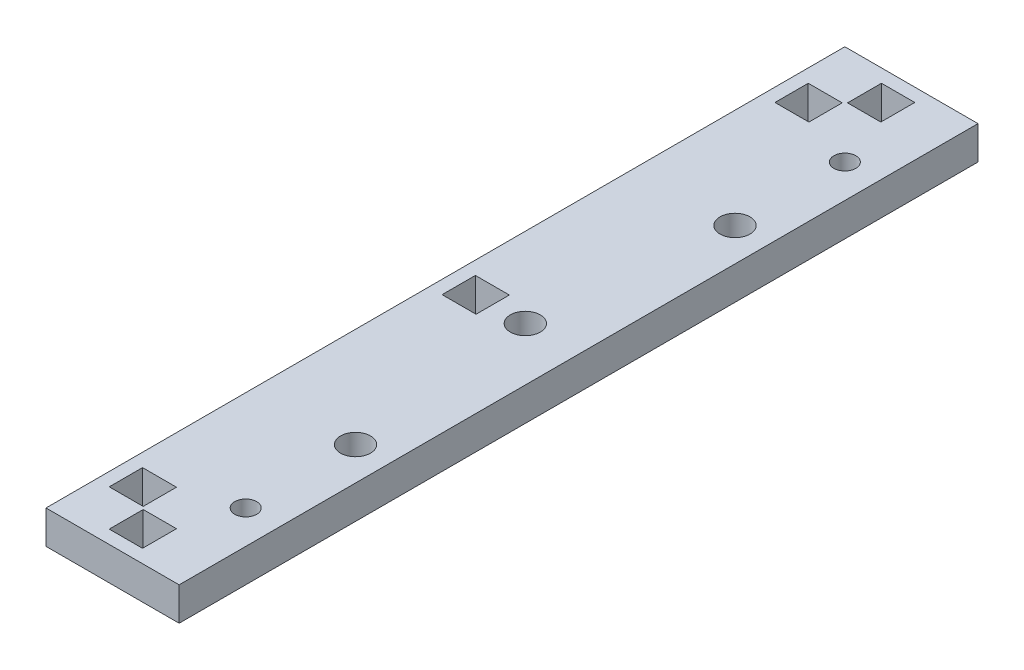
ISO-10303-21;
HEADER;
FILE_DESCRIPTION(('STEP AP214'),'2;1');
FILE_NAME('part.step','',(''),(''),'','','');
FILE_SCHEMA(('AUTOMOTIVE_DESIGN { 1 0 10303 214 1 1 1 1 }'));
ENDSEC;
DATA;
#1=APPLICATION_CONTEXT('core data for automotive mechanical design processes');
#2=APPLICATION_PROTOCOL_DEFINITION('international standard','automotive_design',2000,#1);
#3=PRODUCT_CONTEXT('',#1,'mechanical');
#4=PRODUCT('Part','Part','',(#3));
#5=PRODUCT_RELATED_PRODUCT_CATEGORY('part','',(#4));
#6=PRODUCT_DEFINITION_FORMATION('','',#4);
#7=PRODUCT_DEFINITION_CONTEXT('part definition',#1,'design');
#8=PRODUCT_DEFINITION('design','',#6,#7);
#9=PRODUCT_DEFINITION_SHAPE('','',#8);
#10=(LENGTH_UNIT() NAMED_UNIT(*) SI_UNIT(.MILLI.,.METRE.));
#11=(NAMED_UNIT(*) PLANE_ANGLE_UNIT() SI_UNIT($,.RADIAN.));
#12=(NAMED_UNIT(*) SI_UNIT($,.STERADIAN.) SOLID_ANGLE_UNIT());
#13=UNCERTAINTY_MEASURE_WITH_UNIT(LENGTH_MEASURE(1.E-05),#10,'distance_accuracy_value','');
#14=(GEOMETRIC_REPRESENTATION_CONTEXT(3) GLOBAL_UNCERTAINTY_ASSIGNED_CONTEXT((#13)) GLOBAL_UNIT_ASSIGNED_CONTEXT((#10,
#11,#12)) REPRESENTATION_CONTEXT('',''));
#15=CARTESIAN_POINT('',(0.,0.,0.));
#16=DIRECTION('',(0.,0.,1.));
#17=DIRECTION('',(1.,0.,0.));
#18=AXIS2_PLACEMENT_3D('',#15,#16,#17);
#19=CARTESIAN_POINT('',(10.,5.,60.));
#20=DIRECTION('',(-1.,0.,0.));
#21=DIRECTION('',(0.,0.,1.));
#22=AXIS2_PLACEMENT_3D('',#19,#20,#21);
#23=PLANE('',#22);
#24=DIRECTION('',(0.,0.,-1.));
#25=VECTOR('',#24,1.);
#26=CARTESIAN_POINT('',(10.,0.,60.));
#27=LINE('',#26,#25);
#28=CARTESIAN_POINT('',(10.,0.,60.));
#29=VERTEX_POINT('',#28);
#30=CARTESIAN_POINT('',(10.,0.,-60.));
#31=VERTEX_POINT('',#30);
#32=EDGE_CURVE('E372',#29,#31,#27,.T.);
#33=ORIENTED_EDGE('',*,*,#32,.T.);
#34=DIRECTION('',(0.,-1.,0.));
#35=VECTOR('',#34,1.);
#36=CARTESIAN_POINT('',(10.,5.,-60.));
#37=LINE('',#36,#35);
#38=CARTESIAN_POINT('',(10.,5.,-60.));
#39=VERTEX_POINT('',#38);
#40=EDGE_CURVE('E11',#39,#31,#37,.T.);
#41=ORIENTED_EDGE('',*,*,#40,.F.);
#42=DIRECTION('',(0.,0.,-1.));
#43=VECTOR('',#42,1.);
#44=CARTESIAN_POINT('',(10.,5.,60.));
#45=LINE('',#44,#43);
#46=CARTESIAN_POINT('',(10.,5.,60.));
#47=VERTEX_POINT('',#46);
#48=EDGE_CURVE('E373',#47,#39,#45,.T.);
#49=ORIENTED_EDGE('',*,*,#48,.F.);
#50=DIRECTION('',(0.,-1.,0.));
#51=VECTOR('',#50,1.);
#52=CARTESIAN_POINT('',(10.,5.,60.));
#53=LINE('',#52,#51);
#54=EDGE_CURVE('E383',#47,#29,#53,.T.);
#55=ORIENTED_EDGE('',*,*,#54,.T.);
#56=EDGE_LOOP('',(#33,#41,#49,#55));
#57=FACE_BOUND('',#56,.T.);
#58=ADVANCED_FACE('F33',(#57),#23,.F.);
#59=CARTESIAN_POINT('',(-10.,5.,-60.));
#60=DIRECTION('',(0.,0.,1.));
#61=DIRECTION('',(1.,0.,0.));
#62=AXIS2_PLACEMENT_3D('',#59,#60,#61);
#63=PLANE('',#62);
#64=DIRECTION('',(-1.,0.,0.));
#65=VECTOR('',#64,1.);
#66=CARTESIAN_POINT('',(-10.,0.,-60.));
#67=LINE('',#66,#65);
#68=CARTESIAN_POINT('',(-10.,0.,-60.));
#69=VERTEX_POINT('',#68);
#70=EDGE_CURVE('E386',#31,#69,#67,.T.);
#71=ORIENTED_EDGE('',*,*,#70,.T.);
#72=DIRECTION('',(0.,-1.,0.));
#73=VECTOR('',#72,1.);
#74=CARTESIAN_POINT('',(-10.,5.,-60.));
#75=LINE('',#74,#73);
#76=CARTESIAN_POINT('',(-10.,5.,-60.));
#77=VERTEX_POINT('',#76);
#78=EDGE_CURVE('E40',#77,#69,#75,.T.);
#79=ORIENTED_EDGE('',*,*,#78,.F.);
#80=DIRECTION('',(-1.,0.,0.));
#81=VECTOR('',#80,1.);
#82=CARTESIAN_POINT('',(-10.,5.,-60.));
#83=LINE('',#82,#81);
#84=EDGE_CURVE('E376',#39,#77,#83,.T.);
#85=ORIENTED_EDGE('',*,*,#84,.F.);
#86=ORIENTED_EDGE('',*,*,#40,.T.);
#87=EDGE_LOOP('',(#71,#79,#85,#86));
#88=FACE_BOUND('',#87,.T.);
#89=ADVANCED_FACE('F415',(#88),#63,.F.);
#90=CARTESIAN_POINT('',(-10.,5.,60.));
#91=DIRECTION('',(1.,0.,0.));
#92=DIRECTION('',(0.,0.,-1.));
#93=AXIS2_PLACEMENT_3D('',#90,#91,#92);
#94=PLANE('',#93);
#95=DIRECTION('',(0.,0.,1.));
#96=VECTOR('',#95,1.);
#97=CARTESIAN_POINT('',(-10.,0.,60.));
#98=LINE('',#97,#96);
#99=CARTESIAN_POINT('',(-10.,0.,60.));
#100=VERTEX_POINT('',#99);
#101=EDGE_CURVE('E388',#69,#100,#98,.T.);
#102=ORIENTED_EDGE('',*,*,#101,.T.);
#103=DIRECTION('',(0.,-1.,0.));
#104=VECTOR('',#103,1.);
#105=CARTESIAN_POINT('',(-10.,5.,60.));
#106=LINE('',#105,#104);
#107=CARTESIAN_POINT('',(-10.,5.,60.));
#108=VERTEX_POINT('',#107);
#109=EDGE_CURVE('E393',#108,#100,#106,.T.);
#110=ORIENTED_EDGE('',*,*,#109,.F.);
#111=DIRECTION('',(0.,0.,1.));
#112=VECTOR('',#111,1.);
#113=CARTESIAN_POINT('',(-10.,5.,60.));
#114=LINE('',#113,#112);
#115=EDGE_CURVE('E379',#77,#108,#114,.T.);
#116=ORIENTED_EDGE('',*,*,#115,.F.);
#117=ORIENTED_EDGE('',*,*,#78,.T.);
#118=EDGE_LOOP('',(#102,#110,#116,#117));
#119=FACE_BOUND('',#118,.T.);
#120=ADVANCED_FACE('F400',(#119),#94,.F.);
#121=CARTESIAN_POINT('',(-10.,5.,60.));
#122=DIRECTION('',(0.,0.,-1.));
#123=DIRECTION('',(-1.,0.,0.));
#124=AXIS2_PLACEMENT_3D('',#121,#122,#123);
#125=PLANE('',#124);
#126=DIRECTION('',(1.,0.,0.));
#127=VECTOR('',#126,1.);
#128=CARTESIAN_POINT('',(-10.,0.,60.));
#129=LINE('',#128,#127);
#130=EDGE_CURVE('E377',#100,#29,#129,.T.);
#131=ORIENTED_EDGE('',*,*,#130,.T.);
#132=ORIENTED_EDGE('',*,*,#54,.F.);
#133=DIRECTION('',(1.,0.,0.));
#134=VECTOR('',#133,1.);
#135=CARTESIAN_POINT('',(-10.,5.,60.));
#136=LINE('',#135,#134);
#137=EDGE_CURVE('E381',#108,#47,#136,.T.);
#138=ORIENTED_EDGE('',*,*,#137,.F.);
#139=ORIENTED_EDGE('',*,*,#109,.T.);
#140=EDGE_LOOP('',(#131,#132,#138,#139));
#141=FACE_BOUND('',#140,.T.);
#142=ADVANCED_FACE('F408',(#141),#125,.F.);
#143=CARTESIAN_POINT('',(0.,5.,0.));
#144=DIRECTION('',(0.,-1.,0.));
#145=DIRECTION('',(0.,0.,-1.));
#146=AXIS2_PLACEMENT_3D('',#143,#144,#145);
#147=PLANE('',#146);
#148=CARTESIAN_POINT('',(5.,5.,-28.5));
#149=DIRECTION('',(0.,1.,0.));
#150=DIRECTION('',(0.,0.,1.));
#151=AXIS2_PLACEMENT_3D('',#148,#149,#150);
#152=CIRCLE('',#151,2.24999999999999);
#153=CARTESIAN_POINT('',(5.,5.,-26.25));
#154=VERTEX_POINT('',#153);
#155=EDGE_CURVE('E533',#154,#154,#152,.T.);
#156=ORIENTED_EDGE('',*,*,#155,.F.);
#157=EDGE_LOOP('',(#156));
#158=FACE_BOUND('',#157,.T.);
#159=CARTESIAN_POINT('',(2.,5.,0.));
#160=DIRECTION('',(0.,1.,0.));
#161=DIRECTION('',(0.,0.,1.));
#162=AXIS2_PLACEMENT_3D('',#159,#160,#161);
#163=CIRCLE('',#162,2.24999999999999);
#164=CARTESIAN_POINT('',(2.,5.,2.24999999999999));
#165=VERTEX_POINT('',#164);
#166=EDGE_CURVE('E535',#165,#165,#163,.T.);
#167=ORIENTED_EDGE('',*,*,#166,.F.);
#168=EDGE_LOOP('',(#167));
#169=FACE_BOUND('',#168,.T.);
#170=CARTESIAN_POINT('',(5.,5.,28.5));
#171=DIRECTION('',(0.,1.,0.));
#172=DIRECTION('',(0.,0.,1.));
#173=AXIS2_PLACEMENT_3D('',#170,#171,#172);
#174=CIRCLE('',#173,2.24999999999999);
#175=CARTESIAN_POINT('',(5.,5.,30.75));
#176=VERTEX_POINT('',#175);
#177=EDGE_CURVE('E542',#176,#176,#174,.T.);
#178=ORIENTED_EDGE('',*,*,#177,.F.);
#179=EDGE_LOOP('',(#178));
#180=FACE_BOUND('',#179,.T.);
#181=DIRECTION('',(1.,0.,0.));
#182=VECTOR('',#181,1.);
#183=CARTESIAN_POINT('',(-7.99999999999999,5.,2.50000000000002));
#184=LINE('',#183,#182);
#185=CARTESIAN_POINT('',(-7.99999999999999,5.,2.50000000000002));
#186=VERTEX_POINT('',#185);
#187=CARTESIAN_POINT('',(-2.89999999999999,5.,2.50000000000002));
#188=VERTEX_POINT('',#187);
#189=EDGE_CURVE('E223',#186,#188,#184,.T.);
#190=ORIENTED_EDGE('',*,*,#189,.F.);
#191=DIRECTION('',(0.,0.,1.));
#192=VECTOR('',#191,1.);
#193=CARTESIAN_POINT('',(-7.99999999999999,5.,-2.49999999999998));
#194=LINE('',#193,#192);
#195=CARTESIAN_POINT('',(-7.99999999999999,5.,-2.49999999999998));
#196=VERTEX_POINT('',#195);
#197=EDGE_CURVE('E47',#196,#186,#194,.T.);
#198=ORIENTED_EDGE('',*,*,#197,.F.);
#199=DIRECTION('',(-1.,0.,0.));
#200=VECTOR('',#199,1.);
#201=CARTESIAN_POINT('',(-7.99999999999999,5.,-2.49999999999998));
#202=LINE('',#201,#200);
#203=CARTESIAN_POINT('',(-2.89999999999999,5.,-2.49999999999998));
#204=VERTEX_POINT('',#203);
#205=EDGE_CURVE('E211',#204,#196,#202,.T.);
#206=ORIENTED_EDGE('',*,*,#205,.F.);
#207=DIRECTION('',(0.,0.,-1.));
#208=VECTOR('',#207,1.);
#209=CARTESIAN_POINT('',(-2.89999999999999,5.,-2.49999999999998));
#210=LINE('',#209,#208);
#211=EDGE_CURVE('E214',#188,#204,#210,.T.);
#212=ORIENTED_EDGE('',*,*,#211,.F.);
#213=EDGE_LOOP('',(#190,#198,#206,#212));
#214=FACE_BOUND('',#213,.T.);
#215=DIRECTION('',(1.,0.,0.));
#216=VECTOR('',#215,1.);
#217=CARTESIAN_POINT('',(-2.5,5.,-52.9));
#218=LINE('',#217,#216);
#219=CARTESIAN_POINT('',(-2.5,5.,-52.9));
#220=VERTEX_POINT('',#219);
#221=CARTESIAN_POINT('',(2.5,5.,-52.9));
#222=VERTEX_POINT('',#221);
#223=EDGE_CURVE('E248',#220,#222,#218,.T.);
#224=ORIENTED_EDGE('',*,*,#223,.F.);
#225=DIRECTION('',(0.,0.,1.));
#226=VECTOR('',#225,1.);
#227=CARTESIAN_POINT('',(-2.5,5.,-58.));
#228=LINE('',#227,#226);
#229=CARTESIAN_POINT('',(-2.5,5.,-58.));
#230=VERTEX_POINT('',#229);
#231=EDGE_CURVE('E229',#230,#220,#228,.T.);
#232=ORIENTED_EDGE('',*,*,#231,.F.);
#233=DIRECTION('',(-1.,0.,0.));
#234=VECTOR('',#233,1.);
#235=CARTESIAN_POINT('',(-2.5,5.,-58.));
#236=LINE('',#235,#234);
#237=CARTESIAN_POINT('',(2.5,5.,-58.));
#238=VERTEX_POINT('',#237);
#239=EDGE_CURVE('E237',#238,#230,#236,.T.);
#240=ORIENTED_EDGE('',*,*,#239,.F.);
#241=DIRECTION('',(0.,0.,-1.));
#242=VECTOR('',#241,1.);
#243=CARTESIAN_POINT('',(2.5,5.,-58.));
#244=LINE('',#243,#242);
#245=EDGE_CURVE('E251',#222,#238,#244,.T.);
#246=ORIENTED_EDGE('',*,*,#245,.F.);
#247=EDGE_LOOP('',(#224,#232,#240,#246));
#248=FACE_BOUND('',#247,.T.);
#249=DIRECTION('',(1.,0.,0.));
#250=VECTOR('',#249,1.);
#251=CARTESIAN_POINT('',(-2.49999999999998,5.,58.));
#252=LINE('',#251,#250);
#253=CARTESIAN_POINT('',(-2.49999999999998,5.,58.));
#254=VERTEX_POINT('',#253);
#255=CARTESIAN_POINT('',(2.50000000000001,5.,58.));
#256=VERTEX_POINT('',#255);
#257=EDGE_CURVE('E280',#254,#256,#252,.T.);
#258=ORIENTED_EDGE('',*,*,#257,.F.);
#259=DIRECTION('',(0.,0.,1.));
#260=VECTOR('',#259,1.);
#261=CARTESIAN_POINT('',(-2.49999999999999,5.,52.9));
#262=LINE('',#261,#260);
#263=CARTESIAN_POINT('',(-2.49999999999999,5.,52.9));
#264=VERTEX_POINT('',#263);
#265=EDGE_CURVE('E258',#264,#254,#262,.T.);
#266=ORIENTED_EDGE('',*,*,#265,.F.);
#267=DIRECTION('',(-1.,0.,0.));
#268=VECTOR('',#267,1.);
#269=CARTESIAN_POINT('',(-2.49999999999999,5.,52.9));
#270=LINE('',#269,#268);
#271=CARTESIAN_POINT('',(2.50000000000001,5.,52.9));
#272=VERTEX_POINT('',#271);
#273=EDGE_CURVE('E269',#272,#264,#270,.T.);
#274=ORIENTED_EDGE('',*,*,#273,.F.);
#275=DIRECTION('',(0.,0.,-1.));
#276=VECTOR('',#275,1.);
#277=CARTESIAN_POINT('',(2.50000000000001,5.,52.9));
#278=LINE('',#277,#276);
#279=EDGE_CURVE('E283',#256,#272,#278,.T.);
#280=ORIENTED_EDGE('',*,*,#279,.F.);
#281=EDGE_LOOP('',(#258,#266,#274,#280));
#282=FACE_BOUND('',#281,.T.);
#283=DIRECTION('',(1.,0.,0.));
#284=VECTOR('',#283,1.);
#285=CARTESIAN_POINT('',(-7.99999999999999,5.,52.5));
#286=LINE('',#285,#284);
#287=CARTESIAN_POINT('',(-7.99999999999999,5.,52.5));
#288=VERTEX_POINT('',#287);
#289=CARTESIAN_POINT('',(-2.89999999999999,5.,52.5));
#290=VERTEX_POINT('',#289);
#291=EDGE_CURVE('E312',#288,#290,#286,.T.);
#292=ORIENTED_EDGE('',*,*,#291,.F.);
#293=DIRECTION('',(0.,0.,1.));
#294=VECTOR('',#293,1.);
#295=CARTESIAN_POINT('',(-7.99999999999999,5.,47.5));
#296=LINE('',#295,#294);
#297=CARTESIAN_POINT('',(-7.99999999999999,5.,47.5));
#298=VERTEX_POINT('',#297);
#299=EDGE_CURVE('E290',#298,#288,#296,.T.);
#300=ORIENTED_EDGE('',*,*,#299,.F.);
#301=DIRECTION('',(-1.,0.,0.));
#302=VECTOR('',#301,1.);
#303=CARTESIAN_POINT('',(-7.99999999999999,5.,47.5));
#304=LINE('',#303,#302);
#305=CARTESIAN_POINT('',(-2.89999999999999,5.,47.5));
#306=VERTEX_POINT('',#305);
#307=EDGE_CURVE('E301',#306,#298,#304,.T.);
#308=ORIENTED_EDGE('',*,*,#307,.F.);
#309=DIRECTION('',(0.,0.,-1.));
#310=VECTOR('',#309,1.);
#311=CARTESIAN_POINT('',(-2.89999999999999,5.,47.5));
#312=LINE('',#311,#310);
#313=EDGE_CURVE('E315',#290,#306,#312,.T.);
#314=ORIENTED_EDGE('',*,*,#313,.F.);
#315=EDGE_LOOP('',(#292,#300,#308,#314));
#316=FACE_BOUND('',#315,.T.);
#317=DIRECTION('',(1.,0.,0.));
#318=VECTOR('',#317,1.);
#319=CARTESIAN_POINT('',(-8.,5.,-47.5));
#320=LINE('',#319,#318);
#321=CARTESIAN_POINT('',(-8.,5.,-47.5));
#322=VERTEX_POINT('',#321);
#323=CARTESIAN_POINT('',(-2.89999999999999,5.,-47.5));
#324=VERTEX_POINT('',#323);
#325=EDGE_CURVE('E344',#322,#324,#320,.T.);
#326=ORIENTED_EDGE('',*,*,#325,.F.);
#327=DIRECTION('',(0.,0.,1.));
#328=VECTOR('',#327,1.);
#329=CARTESIAN_POINT('',(-8.,5.,-52.5));
#330=LINE('',#329,#328);
#331=CARTESIAN_POINT('',(-8.,5.,-52.5));
#332=VERTEX_POINT('',#331);
#333=EDGE_CURVE('E322',#332,#322,#330,.T.);
#334=ORIENTED_EDGE('',*,*,#333,.F.);
#335=DIRECTION('',(-1.,0.,0.));
#336=VECTOR('',#335,1.);
#337=CARTESIAN_POINT('',(-8.,5.,-52.5));
#338=LINE('',#337,#336);
#339=CARTESIAN_POINT('',(-2.89999999999999,5.,-52.5));
#340=VERTEX_POINT('',#339);
#341=EDGE_CURVE('E333',#340,#332,#338,.T.);
#342=ORIENTED_EDGE('',*,*,#341,.F.);
#343=DIRECTION('',(0.,0.,-1.));
#344=VECTOR('',#343,1.);
#345=CARTESIAN_POINT('',(-2.89999999999999,5.,-52.5));
#346=LINE('',#345,#344);
#347=EDGE_CURVE('E347',#324,#340,#346,.T.);
#348=ORIENTED_EDGE('',*,*,#347,.F.);
#349=EDGE_LOOP('',(#326,#334,#342,#348));
#350=FACE_BOUND('',#349,.T.);
#351=CARTESIAN_POINT('',(4.99999999999999,5.,-45.));
#352=DIRECTION('',(0.,1.,0.));
#353=DIRECTION('',(0.,0.,1.));
#354=AXIS2_PLACEMENT_3D('',#351,#352,#353);
#355=CIRCLE('',#354,1.64999999999999);
#356=CARTESIAN_POINT('',(4.99999999999999,5.,-43.35));
#357=VERTEX_POINT('',#356);
#358=EDGE_CURVE('E354',#357,#357,#355,.T.);
#359=ORIENTED_EDGE('',*,*,#358,.F.);
#360=EDGE_LOOP('',(#359));
#361=FACE_BOUND('',#360,.T.);
#362=CARTESIAN_POINT('',(4.99999999999999,5.,45.));
#363=DIRECTION('',(0.,1.,0.));
#364=DIRECTION('',(0.,0.,1.));
#365=AXIS2_PLACEMENT_3D('',#362,#363,#364);
#366=CIRCLE('',#365,1.64999999999999);
#367=CARTESIAN_POINT('',(4.99999999999999,5.,46.65));
#368=VERTEX_POINT('',#367);
#369=EDGE_CURVE('E366',#368,#368,#366,.T.);
#370=ORIENTED_EDGE('',*,*,#369,.F.);
#371=EDGE_LOOP('',(#370));
#372=FACE_BOUND('',#371,.T.);
#373=ORIENTED_EDGE('',*,*,#48,.T.);
#374=ORIENTED_EDGE('',*,*,#84,.T.);
#375=ORIENTED_EDGE('',*,*,#115,.T.);
#376=ORIENTED_EDGE('',*,*,#137,.T.);
#377=EDGE_LOOP('',(#373,#374,#375,#376));
#378=FACE_BOUND('',#377,.T.);
#379=ADVANCED_FACE('F414',(#158,#169,#180,#214,#248,#282,#316,#350,#361,#372,#378),#147,.F.);
#380=CARTESIAN_POINT('',(0.,0.,0.));
#381=DIRECTION('',(0.,-1.,0.));
#382=DIRECTION('',(0.,0.,-1.));
#383=AXIS2_PLACEMENT_3D('',#380,#381,#382);
#384=PLANE('',#383);
#385=CARTESIAN_POINT('',(5.,0.,-28.5));
#386=DIRECTION('',(0.,1.,0.));
#387=DIRECTION('',(0.,0.,1.));
#388=AXIS2_PLACEMENT_3D('',#385,#386,#387);
#389=CIRCLE('',#388,2.24999999999999);
#390=CARTESIAN_POINT('',(5.,0.,-26.25));
#391=VERTEX_POINT('',#390);
#392=EDGE_CURVE('E530',#391,#391,#389,.T.);
#393=ORIENTED_EDGE('',*,*,#392,.T.);
#394=EDGE_LOOP('',(#393));
#395=FACE_BOUND('',#394,.T.);
#396=CARTESIAN_POINT('',(2.,0.,0.));
#397=DIRECTION('',(0.,1.,0.));
#398=DIRECTION('',(0.,0.,1.));
#399=AXIS2_PLACEMENT_3D('',#396,#397,#398);
#400=CIRCLE('',#399,2.24999999999999);
#401=CARTESIAN_POINT('',(2.,0.,2.24999999999999));
#402=VERTEX_POINT('',#401);
#403=EDGE_CURVE('E540',#402,#402,#400,.T.);
#404=ORIENTED_EDGE('',*,*,#403,.T.);
#405=EDGE_LOOP('',(#404));
#406=FACE_BOUND('',#405,.T.);
#407=CARTESIAN_POINT('',(5.,0.,28.5));
#408=DIRECTION('',(0.,1.,0.));
#409=DIRECTION('',(0.,0.,1.));
#410=AXIS2_PLACEMENT_3D('',#407,#408,#409);
#411=CIRCLE('',#410,2.24999999999999);
#412=CARTESIAN_POINT('',(5.,0.,30.75));
#413=VERTEX_POINT('',#412);
#414=EDGE_CURVE('E217',#413,#413,#411,.T.);
#415=ORIENTED_EDGE('',*,*,#414,.T.);
#416=EDGE_LOOP('',(#415));
#417=FACE_BOUND('',#416,.T.);
#418=DIRECTION('',(0.,0.,1.));
#419=VECTOR('',#418,1.);
#420=CARTESIAN_POINT('',(-7.99999999999999,0.,-2.49999999999998));
#421=LINE('',#420,#419);
#422=CARTESIAN_POINT('',(-7.99999999999999,0.,-2.49999999999998));
#423=VERTEX_POINT('',#422);
#424=CARTESIAN_POINT('',(-7.99999999999999,0.,2.50000000000002));
#425=VERTEX_POINT('',#424);
#426=EDGE_CURVE('E195',#423,#425,#421,.T.);
#427=ORIENTED_EDGE('',*,*,#426,.T.);
#428=DIRECTION('',(1.,0.,0.));
#429=VECTOR('',#428,1.);
#430=CARTESIAN_POINT('',(-7.99999999999999,0.,2.50000000000002));
#431=LINE('',#430,#429);
#432=CARTESIAN_POINT('',(-2.89999999999999,0.,2.50000000000002));
#433=VERTEX_POINT('',#432);
#434=EDGE_CURVE('E204',#425,#433,#431,.T.);
#435=ORIENTED_EDGE('',*,*,#434,.T.);
#436=DIRECTION('',(0.,0.,-1.));
#437=VECTOR('',#436,1.);
#438=CARTESIAN_POINT('',(-2.89999999999999,0.,-2.49999999999998));
#439=LINE('',#438,#437);
#440=CARTESIAN_POINT('',(-2.89999999999999,0.,-2.49999999999998));
#441=VERTEX_POINT('',#440);
#442=EDGE_CURVE('E55',#433,#441,#439,.T.);
#443=ORIENTED_EDGE('',*,*,#442,.T.);
#444=DIRECTION('',(-1.,0.,0.));
#445=VECTOR('',#444,1.);
#446=CARTESIAN_POINT('',(-7.99999999999999,0.,-2.49999999999998));
#447=LINE('',#446,#445);
#448=EDGE_CURVE('E201',#441,#423,#447,.T.);
#449=ORIENTED_EDGE('',*,*,#448,.T.);
#450=EDGE_LOOP('',(#427,#435,#443,#449));
#451=FACE_BOUND('',#450,.T.);
#452=DIRECTION('',(0.,0.,1.));
#453=VECTOR('',#452,1.);
#454=CARTESIAN_POINT('',(-2.5,0.,-58.));
#455=LINE('',#454,#453);
#456=CARTESIAN_POINT('',(-2.5,0.,-58.));
#457=VERTEX_POINT('',#456);
#458=CARTESIAN_POINT('',(-2.5,0.,-52.9));
#459=VERTEX_POINT('',#458);
#460=EDGE_CURVE('E233',#457,#459,#455,.T.);
#461=ORIENTED_EDGE('',*,*,#460,.T.);
#462=DIRECTION('',(1.,0.,0.));
#463=VECTOR('',#462,1.);
#464=CARTESIAN_POINT('',(-2.5,0.,-52.9));
#465=LINE('',#464,#463);
#466=CARTESIAN_POINT('',(2.5,0.,-52.9));
#467=VERTEX_POINT('',#466);
#468=EDGE_CURVE('E236',#459,#467,#465,.T.);
#469=ORIENTED_EDGE('',*,*,#468,.T.);
#470=DIRECTION('',(0.,0.,-1.));
#471=VECTOR('',#470,1.);
#472=CARTESIAN_POINT('',(2.5,0.,-58.));
#473=LINE('',#472,#471);
#474=CARTESIAN_POINT('',(2.5,0.,-58.));
#475=VERTEX_POINT('',#474);
#476=EDGE_CURVE('E240',#467,#475,#473,.T.);
#477=ORIENTED_EDGE('',*,*,#476,.T.);
#478=DIRECTION('',(-1.,0.,0.));
#479=VECTOR('',#478,1.);
#480=CARTESIAN_POINT('',(-2.5,0.,-58.));
#481=LINE('',#480,#479);
#482=EDGE_CURVE('E243',#475,#457,#481,.T.);
#483=ORIENTED_EDGE('',*,*,#482,.T.);
#484=EDGE_LOOP('',(#461,#469,#477,#483));
#485=FACE_BOUND('',#484,.T.);
#486=DIRECTION('',(0.,0.,1.));
#487=VECTOR('',#486,1.);
#488=CARTESIAN_POINT('',(-2.49999999999999,0.,52.9));
#489=LINE('',#488,#487);
#490=CARTESIAN_POINT('',(-2.49999999999999,0.,52.9));
#491=VERTEX_POINT('',#490);
#492=CARTESIAN_POINT('',(-2.49999999999998,0.,58.));
#493=VERTEX_POINT('',#492);
#494=EDGE_CURVE('E265',#491,#493,#489,.T.);
#495=ORIENTED_EDGE('',*,*,#494,.T.);
#496=DIRECTION('',(1.,0.,0.));
#497=VECTOR('',#496,1.);
#498=CARTESIAN_POINT('',(-2.49999999999998,0.,58.));
#499=LINE('',#498,#497);
#500=CARTESIAN_POINT('',(2.50000000000001,0.,58.));
#501=VERTEX_POINT('',#500);
#502=EDGE_CURVE('E268',#493,#501,#499,.T.);
#503=ORIENTED_EDGE('',*,*,#502,.T.);
#504=DIRECTION('',(0.,0.,-1.));
#505=VECTOR('',#504,1.);
#506=CARTESIAN_POINT('',(2.50000000000001,0.,52.9));
#507=LINE('',#506,#505);
#508=CARTESIAN_POINT('',(2.50000000000001,0.,52.9));
#509=VERTEX_POINT('',#508);
#510=EDGE_CURVE('E272',#501,#509,#507,.T.);
#511=ORIENTED_EDGE('',*,*,#510,.T.);
#512=DIRECTION('',(-1.,0.,0.));
#513=VECTOR('',#512,1.);
#514=CARTESIAN_POINT('',(-2.49999999999999,0.,52.9));
#515=LINE('',#514,#513);
#516=EDGE_CURVE('E275',#509,#491,#515,.T.);
#517=ORIENTED_EDGE('',*,*,#516,.T.);
#518=EDGE_LOOP('',(#495,#503,#511,#517));
#519=FACE_BOUND('',#518,.T.);
#520=DIRECTION('',(0.,0.,1.));
#521=VECTOR('',#520,1.);
#522=CARTESIAN_POINT('',(-7.99999999999999,0.,47.5));
#523=LINE('',#522,#521);
#524=CARTESIAN_POINT('',(-7.99999999999999,0.,47.5));
#525=VERTEX_POINT('',#524);
#526=CARTESIAN_POINT('',(-7.99999999999999,0.,52.5));
#527=VERTEX_POINT('',#526);
#528=EDGE_CURVE('E297',#525,#527,#523,.T.);
#529=ORIENTED_EDGE('',*,*,#528,.T.);
#530=DIRECTION('',(1.,0.,0.));
#531=VECTOR('',#530,1.);
#532=CARTESIAN_POINT('',(-7.99999999999999,0.,52.5));
#533=LINE('',#532,#531);
#534=CARTESIAN_POINT('',(-2.89999999999999,0.,52.5));
#535=VERTEX_POINT('',#534);
#536=EDGE_CURVE('E300',#527,#535,#533,.T.);
#537=ORIENTED_EDGE('',*,*,#536,.T.);
#538=DIRECTION('',(0.,0.,-1.));
#539=VECTOR('',#538,1.);
#540=CARTESIAN_POINT('',(-2.89999999999999,0.,47.5));
#541=LINE('',#540,#539);
#542=CARTESIAN_POINT('',(-2.89999999999999,0.,47.5));
#543=VERTEX_POINT('',#542);
#544=EDGE_CURVE('E304',#535,#543,#541,.T.);
#545=ORIENTED_EDGE('',*,*,#544,.T.);
#546=DIRECTION('',(-1.,0.,0.));
#547=VECTOR('',#546,1.);
#548=CARTESIAN_POINT('',(-7.99999999999999,0.,47.5));
#549=LINE('',#548,#547);
#550=EDGE_CURVE('E307',#543,#525,#549,.T.);
#551=ORIENTED_EDGE('',*,*,#550,.T.);
#552=EDGE_LOOP('',(#529,#537,#545,#551));
#553=FACE_BOUND('',#552,.T.);
#554=DIRECTION('',(0.,0.,1.));
#555=VECTOR('',#554,1.);
#556=CARTESIAN_POINT('',(-8.,0.,-52.5));
#557=LINE('',#556,#555);
#558=CARTESIAN_POINT('',(-8.,0.,-52.5));
#559=VERTEX_POINT('',#558);
#560=CARTESIAN_POINT('',(-8.,0.,-47.5));
#561=VERTEX_POINT('',#560);
#562=EDGE_CURVE('E329',#559,#561,#557,.T.);
#563=ORIENTED_EDGE('',*,*,#562,.T.);
#564=DIRECTION('',(1.,0.,0.));
#565=VECTOR('',#564,1.);
#566=CARTESIAN_POINT('',(-8.,0.,-47.5));
#567=LINE('',#566,#565);
#568=CARTESIAN_POINT('',(-2.89999999999999,0.,-47.5));
#569=VERTEX_POINT('',#568);
#570=EDGE_CURVE('E332',#561,#569,#567,.T.);
#571=ORIENTED_EDGE('',*,*,#570,.T.);
#572=DIRECTION('',(0.,0.,-1.));
#573=VECTOR('',#572,1.);
#574=CARTESIAN_POINT('',(-2.89999999999999,0.,-52.5));
#575=LINE('',#574,#573);
#576=CARTESIAN_POINT('',(-2.89999999999999,0.,-52.5));
#577=VERTEX_POINT('',#576);
#578=EDGE_CURVE('E336',#569,#577,#575,.T.);
#579=ORIENTED_EDGE('',*,*,#578,.T.);
#580=DIRECTION('',(-1.,0.,0.));
#581=VECTOR('',#580,1.);
#582=CARTESIAN_POINT('',(-8.,0.,-52.5));
#583=LINE('',#582,#581);
#584=EDGE_CURVE('E339',#577,#559,#583,.T.);
#585=ORIENTED_EDGE('',*,*,#584,.T.);
#586=EDGE_LOOP('',(#563,#571,#579,#585));
#587=FACE_BOUND('',#586,.T.);
#588=CARTESIAN_POINT('',(4.99999999999999,0.,-45.));
#589=DIRECTION('',(0.,1.,0.));
#590=DIRECTION('',(0.,0.,1.));
#591=AXIS2_PLACEMENT_3D('',#588,#589,#590);
#592=CIRCLE('',#591,1.64999999999999);
#593=CARTESIAN_POINT('',(4.99999999999999,0.,-43.35));
#594=VERTEX_POINT('',#593);
#595=EDGE_CURVE('E363',#594,#594,#592,.T.);
#596=ORIENTED_EDGE('',*,*,#595,.T.);
#597=EDGE_LOOP('',(#596));
#598=FACE_BOUND('',#597,.T.);
#599=CARTESIAN_POINT('',(4.99999999999999,0.,45.));
#600=DIRECTION('',(0.,1.,0.));
#601=DIRECTION('',(0.,0.,1.));
#602=AXIS2_PLACEMENT_3D('',#599,#600,#601);
#603=CIRCLE('',#602,1.64999999999999);
#604=CARTESIAN_POINT('',(4.99999999999999,0.,46.65));
#605=VERTEX_POINT('',#604);
#606=EDGE_CURVE('E369',#605,#605,#603,.T.);
#607=ORIENTED_EDGE('',*,*,#606,.T.);
#608=EDGE_LOOP('',(#607));
#609=FACE_BOUND('',#608,.T.);
#610=ORIENTED_EDGE('',*,*,#32,.F.);
#611=ORIENTED_EDGE('',*,*,#130,.F.);
#612=ORIENTED_EDGE('',*,*,#101,.F.);
#613=ORIENTED_EDGE('',*,*,#70,.F.);
#614=EDGE_LOOP('',(#610,#611,#612,#613));
#615=FACE_BOUND('',#614,.T.);
#616=ADVANCED_FACE('F208',(#395,#406,#417,#451,#485,#519,#553,#587,#598,#609,#615),#384,.T.);
#617=CARTESIAN_POINT('',(4.99999999999999,5.,45.));
#618=DIRECTION('',(0.,1.,0.));
#619=DIRECTION('',(0.,0.,1.));
#620=AXIS2_PLACEMENT_3D('',#617,#618,#619);
#621=CYLINDRICAL_SURFACE('',#620,1.64999999999999);
#622=ORIENTED_EDGE('',*,*,#606,.F.);
#623=EDGE_LOOP('',(#622));
#624=FACE_BOUND('',#623,.T.);
#625=ORIENTED_EDGE('',*,*,#369,.T.);
#626=EDGE_LOOP('',(#625));
#627=FACE_BOUND('',#626,.T.);
#628=ADVANCED_FACE('F427',(#624,#627),#621,.F.);
#629=CARTESIAN_POINT('',(4.99999999999999,5.,-45.));
#630=DIRECTION('',(0.,1.,0.));
#631=DIRECTION('',(0.,0.,1.));
#632=AXIS2_PLACEMENT_3D('',#629,#630,#631);
#633=CYLINDRICAL_SURFACE('',#632,1.64999999999999);
#634=ORIENTED_EDGE('',*,*,#595,.F.);
#635=EDGE_LOOP('',(#634));
#636=FACE_BOUND('',#635,.T.);
#637=ORIENTED_EDGE('',*,*,#358,.T.);
#638=EDGE_LOOP('',(#637));
#639=FACE_BOUND('',#638,.T.);
#640=ADVANCED_FACE('F434',(#636,#639),#633,.F.);
#641=CARTESIAN_POINT('',(-8.,0.,-52.5));
#642=DIRECTION('',(-1.,0.,0.));
#643=DIRECTION('',(0.,0.,1.));
#644=AXIS2_PLACEMENT_3D('',#641,#642,#643);
#645=PLANE('',#644);
#646=ORIENTED_EDGE('',*,*,#333,.T.);
#647=DIRECTION('',(0.,1.,0.));
#648=VECTOR('',#647,1.);
#649=CARTESIAN_POINT('',(-8.,0.,-47.5));
#650=LINE('',#649,#648);
#651=EDGE_CURVE('E342',#561,#322,#650,.T.);
#652=ORIENTED_EDGE('',*,*,#651,.F.);
#653=ORIENTED_EDGE('',*,*,#562,.F.);
#654=DIRECTION('',(0.,1.,0.));
#655=VECTOR('',#654,1.);
#656=CARTESIAN_POINT('',(-8.,0.,-52.5));
#657=LINE('',#656,#655);
#658=EDGE_CURVE('E352',#559,#332,#657,.T.);
#659=ORIENTED_EDGE('',*,*,#658,.T.);
#660=EDGE_LOOP('',(#646,#652,#653,#659));
#661=FACE_BOUND('',#660,.T.);
#662=ADVANCED_FACE('F438',(#661),#645,.F.);
#663=CARTESIAN_POINT('',(-8.,0.,-52.5));
#664=DIRECTION('',(0.,0.,-1.));
#665=DIRECTION('',(-1.,0.,0.));
#666=AXIS2_PLACEMENT_3D('',#663,#664,#665);
#667=PLANE('',#666);
#668=ORIENTED_EDGE('',*,*,#341,.T.);
#669=ORIENTED_EDGE('',*,*,#658,.F.);
#670=ORIENTED_EDGE('',*,*,#584,.F.);
#671=DIRECTION('',(0.,1.,0.));
#672=VECTOR('',#671,1.);
#673=CARTESIAN_POINT('',(-2.89999999999999,0.,-52.5));
#674=LINE('',#673,#672);
#675=EDGE_CURVE('E355',#577,#340,#674,.T.);
#676=ORIENTED_EDGE('',*,*,#675,.T.);
#677=EDGE_LOOP('',(#668,#669,#670,#676));
#678=FACE_BOUND('',#677,.T.);
#679=ADVANCED_FACE('F442',(#678),#667,.F.);
#680=CARTESIAN_POINT('',(-2.89999999999999,0.,-52.5));
#681=DIRECTION('',(1.,0.,0.));
#682=DIRECTION('',(0.,0.,-1.));
#683=AXIS2_PLACEMENT_3D('',#680,#681,#682);
#684=PLANE('',#683);
#685=ORIENTED_EDGE('',*,*,#347,.T.);
#686=ORIENTED_EDGE('',*,*,#675,.F.);
#687=ORIENTED_EDGE('',*,*,#578,.F.);
#688=DIRECTION('',(0.,1.,0.));
#689=VECTOR('',#688,1.);
#690=CARTESIAN_POINT('',(-2.89999999999999,0.,-47.5));
#691=LINE('',#690,#689);
#692=EDGE_CURVE('E357',#569,#324,#691,.T.);
#693=ORIENTED_EDGE('',*,*,#692,.T.);
#694=EDGE_LOOP('',(#685,#686,#687,#693));
#695=FACE_BOUND('',#694,.T.);
#696=ADVANCED_FACE('F448',(#695),#684,.F.);
#697=CARTESIAN_POINT('',(-8.,0.,-47.5));
#698=DIRECTION('',(0.,0.,1.));
#699=DIRECTION('',(1.,0.,0.));
#700=AXIS2_PLACEMENT_3D('',#697,#698,#699);
#701=PLANE('',#700);
#702=ORIENTED_EDGE('',*,*,#325,.T.);
#703=ORIENTED_EDGE('',*,*,#692,.F.);
#704=ORIENTED_EDGE('',*,*,#570,.F.);
#705=ORIENTED_EDGE('',*,*,#651,.T.);
#706=EDGE_LOOP('',(#702,#703,#704,#705));
#707=FACE_BOUND('',#706,.T.);
#708=ADVANCED_FACE('F444',(#707),#701,.F.);
#709=CARTESIAN_POINT('',(-7.99999999999999,0.,47.5));
#710=DIRECTION('',(-1.,0.,0.));
#711=DIRECTION('',(0.,0.,1.));
#712=AXIS2_PLACEMENT_3D('',#709,#710,#711);
#713=PLANE('',#712);
#714=ORIENTED_EDGE('',*,*,#299,.T.);
#715=DIRECTION('',(0.,1.,0.));
#716=VECTOR('',#715,1.);
#717=CARTESIAN_POINT('',(-7.99999999999999,0.,52.5));
#718=LINE('',#717,#716);
#719=EDGE_CURVE('E310',#527,#288,#718,.T.);
#720=ORIENTED_EDGE('',*,*,#719,.F.);
#721=ORIENTED_EDGE('',*,*,#528,.F.);
#722=DIRECTION('',(0.,1.,0.));
#723=VECTOR('',#722,1.);
#724=CARTESIAN_POINT('',(-7.99999999999999,0.,47.5));
#725=LINE('',#724,#723);
#726=EDGE_CURVE('E320',#525,#298,#725,.T.);
#727=ORIENTED_EDGE('',*,*,#726,.T.);
#728=EDGE_LOOP('',(#714,#720,#721,#727));
#729=FACE_BOUND('',#728,.T.);
#730=ADVANCED_FACE('F447',(#729),#713,.F.);
#731=CARTESIAN_POINT('',(-7.99999999999999,0.,47.5));
#732=DIRECTION('',(0.,0.,-1.));
#733=DIRECTION('',(-1.,0.,0.));
#734=AXIS2_PLACEMENT_3D('',#731,#732,#733);
#735=PLANE('',#734);
#736=ORIENTED_EDGE('',*,*,#307,.T.);
#737=ORIENTED_EDGE('',*,*,#726,.F.);
#738=ORIENTED_EDGE('',*,*,#550,.F.);
#739=DIRECTION('',(0.,1.,0.));
#740=VECTOR('',#739,1.);
#741=CARTESIAN_POINT('',(-2.89999999999999,0.,47.5));
#742=LINE('',#741,#740);
#743=EDGE_CURVE('E323',#543,#306,#742,.T.);
#744=ORIENTED_EDGE('',*,*,#743,.T.);
#745=EDGE_LOOP('',(#736,#737,#738,#744));
#746=FACE_BOUND('',#745,.T.);
#747=ADVANCED_FACE('F458',(#746),#735,.F.);
#748=CARTESIAN_POINT('',(-2.89999999999999,0.,47.5));
#749=DIRECTION('',(1.,0.,0.));
#750=DIRECTION('',(0.,0.,-1.));
#751=AXIS2_PLACEMENT_3D('',#748,#749,#750);
#752=PLANE('',#751);
#753=ORIENTED_EDGE('',*,*,#313,.T.);
#754=ORIENTED_EDGE('',*,*,#743,.F.);
#755=ORIENTED_EDGE('',*,*,#544,.F.);
#756=DIRECTION('',(0.,1.,0.));
#757=VECTOR('',#756,1.);
#758=CARTESIAN_POINT('',(-2.89999999999999,0.,52.5));
#759=LINE('',#758,#757);
#760=EDGE_CURVE('E325',#535,#290,#759,.T.);
#761=ORIENTED_EDGE('',*,*,#760,.T.);
#762=EDGE_LOOP('',(#753,#754,#755,#761));
#763=FACE_BOUND('',#762,.T.);
#764=ADVANCED_FACE('F464',(#763),#752,.F.);
#765=CARTESIAN_POINT('',(-7.99999999999999,0.,52.5));
#766=DIRECTION('',(0.,0.,1.));
#767=DIRECTION('',(1.,0.,0.));
#768=AXIS2_PLACEMENT_3D('',#765,#766,#767);
#769=PLANE('',#768);
#770=ORIENTED_EDGE('',*,*,#291,.T.);
#771=ORIENTED_EDGE('',*,*,#760,.F.);
#772=ORIENTED_EDGE('',*,*,#536,.F.);
#773=ORIENTED_EDGE('',*,*,#719,.T.);
#774=EDGE_LOOP('',(#770,#771,#772,#773));
#775=FACE_BOUND('',#774,.T.);
#776=ADVANCED_FACE('F460',(#775),#769,.F.);
#777=CARTESIAN_POINT('',(-2.49999999999999,0.,52.9));
#778=DIRECTION('',(-1.,0.,0.));
#779=DIRECTION('',(0.,0.,1.));
#780=AXIS2_PLACEMENT_3D('',#777,#778,#779);
#781=PLANE('',#780);
#782=ORIENTED_EDGE('',*,*,#265,.T.);
#783=DIRECTION('',(0.,1.,0.));
#784=VECTOR('',#783,1.);
#785=CARTESIAN_POINT('',(-2.49999999999998,0.,58.));
#786=LINE('',#785,#784);
#787=EDGE_CURVE('E278',#493,#254,#786,.T.);
#788=ORIENTED_EDGE('',*,*,#787,.F.);
#789=ORIENTED_EDGE('',*,*,#494,.F.);
#790=DIRECTION('',(0.,1.,0.));
#791=VECTOR('',#790,1.);
#792=CARTESIAN_POINT('',(-2.49999999999999,0.,52.9));
#793=LINE('',#792,#791);
#794=EDGE_CURVE('E288',#491,#264,#793,.T.);
#795=ORIENTED_EDGE('',*,*,#794,.T.);
#796=EDGE_LOOP('',(#782,#788,#789,#795));
#797=FACE_BOUND('',#796,.T.);
#798=ADVANCED_FACE('F463',(#797),#781,.F.);
#799=CARTESIAN_POINT('',(-2.49999999999999,0.,52.9));
#800=DIRECTION('',(0.,0.,-1.));
#801=DIRECTION('',(-1.,0.,0.));
#802=AXIS2_PLACEMENT_3D('',#799,#800,#801);
#803=PLANE('',#802);
#804=ORIENTED_EDGE('',*,*,#273,.T.);
#805=ORIENTED_EDGE('',*,*,#794,.F.);
#806=ORIENTED_EDGE('',*,*,#516,.F.);
#807=DIRECTION('',(0.,1.,0.));
#808=VECTOR('',#807,1.);
#809=CARTESIAN_POINT('',(2.50000000000001,0.,52.9));
#810=LINE('',#809,#808);
#811=EDGE_CURVE('E291',#509,#272,#810,.T.);
#812=ORIENTED_EDGE('',*,*,#811,.T.);
#813=EDGE_LOOP('',(#804,#805,#806,#812));
#814=FACE_BOUND('',#813,.T.);
#815=ADVANCED_FACE('F474',(#814),#803,.F.);
#816=CARTESIAN_POINT('',(2.50000000000001,0.,52.9));
#817=DIRECTION('',(1.,0.,0.));
#818=DIRECTION('',(0.,0.,-1.));
#819=AXIS2_PLACEMENT_3D('',#816,#817,#818);
#820=PLANE('',#819);
#821=ORIENTED_EDGE('',*,*,#279,.T.);
#822=ORIENTED_EDGE('',*,*,#811,.F.);
#823=ORIENTED_EDGE('',*,*,#510,.F.);
#824=DIRECTION('',(0.,1.,0.));
#825=VECTOR('',#824,1.);
#826=CARTESIAN_POINT('',(2.50000000000001,0.,58.));
#827=LINE('',#826,#825);
#828=EDGE_CURVE('E293',#501,#256,#827,.T.);
#829=ORIENTED_EDGE('',*,*,#828,.T.);
#830=EDGE_LOOP('',(#821,#822,#823,#829));
#831=FACE_BOUND('',#830,.T.);
#832=ADVANCED_FACE('F480',(#831),#820,.F.);
#833=CARTESIAN_POINT('',(-2.49999999999998,0.,58.));
#834=DIRECTION('',(0.,0.,1.));
#835=DIRECTION('',(1.,0.,0.));
#836=AXIS2_PLACEMENT_3D('',#833,#834,#835);
#837=PLANE('',#836);
#838=ORIENTED_EDGE('',*,*,#257,.T.);
#839=ORIENTED_EDGE('',*,*,#828,.F.);
#840=ORIENTED_EDGE('',*,*,#502,.F.);
#841=ORIENTED_EDGE('',*,*,#787,.T.);
#842=EDGE_LOOP('',(#838,#839,#840,#841));
#843=FACE_BOUND('',#842,.T.);
#844=ADVANCED_FACE('F476',(#843),#837,.F.);
#845=CARTESIAN_POINT('',(-2.5,0.,-58.));
#846=DIRECTION('',(-1.,0.,0.));
#847=DIRECTION('',(0.,0.,1.));
#848=AXIS2_PLACEMENT_3D('',#845,#846,#847);
#849=PLANE('',#848);
#850=ORIENTED_EDGE('',*,*,#231,.T.);
#851=DIRECTION('',(0.,1.,0.));
#852=VECTOR('',#851,1.);
#853=CARTESIAN_POINT('',(-2.5,0.,-52.9));
#854=LINE('',#853,#852);
#855=EDGE_CURVE('E246',#459,#220,#854,.T.);
#856=ORIENTED_EDGE('',*,*,#855,.F.);
#857=ORIENTED_EDGE('',*,*,#460,.F.);
#858=DIRECTION('',(0.,1.,0.));
#859=VECTOR('',#858,1.);
#860=CARTESIAN_POINT('',(-2.5,0.,-58.));
#861=LINE('',#860,#859);
#862=EDGE_CURVE('E256',#457,#230,#861,.T.);
#863=ORIENTED_EDGE('',*,*,#862,.T.);
#864=EDGE_LOOP('',(#850,#856,#857,#863));
#865=FACE_BOUND('',#864,.T.);
#866=ADVANCED_FACE('F479',(#865),#849,.F.);
#867=CARTESIAN_POINT('',(-2.5,0.,-58.));
#868=DIRECTION('',(0.,0.,-1.));
#869=DIRECTION('',(-1.,0.,0.));
#870=AXIS2_PLACEMENT_3D('',#867,#868,#869);
#871=PLANE('',#870);
#872=ORIENTED_EDGE('',*,*,#239,.T.);
#873=ORIENTED_EDGE('',*,*,#862,.F.);
#874=ORIENTED_EDGE('',*,*,#482,.F.);
#875=DIRECTION('',(0.,1.,0.));
#876=VECTOR('',#875,1.);
#877=CARTESIAN_POINT('',(2.5,0.,-58.));
#878=LINE('',#877,#876);
#879=EDGE_CURVE('E259',#475,#238,#878,.T.);
#880=ORIENTED_EDGE('',*,*,#879,.T.);
#881=EDGE_LOOP('',(#872,#873,#874,#880));
#882=FACE_BOUND('',#881,.T.);
#883=ADVANCED_FACE('F490',(#882),#871,.F.);
#884=CARTESIAN_POINT('',(2.5,0.,-58.));
#885=DIRECTION('',(1.,0.,0.));
#886=DIRECTION('',(0.,0.,-1.));
#887=AXIS2_PLACEMENT_3D('',#884,#885,#886);
#888=PLANE('',#887);
#889=ORIENTED_EDGE('',*,*,#245,.T.);
#890=ORIENTED_EDGE('',*,*,#879,.F.);
#891=ORIENTED_EDGE('',*,*,#476,.F.);
#892=DIRECTION('',(0.,1.,0.));
#893=VECTOR('',#892,1.);
#894=CARTESIAN_POINT('',(2.5,0.,-52.9));
#895=LINE('',#894,#893);
#896=EDGE_CURVE('E261',#467,#222,#895,.T.);
#897=ORIENTED_EDGE('',*,*,#896,.T.);
#898=EDGE_LOOP('',(#889,#890,#891,#897));
#899=FACE_BOUND('',#898,.T.);
#900=ADVANCED_FACE('F495',(#899),#888,.F.);
#901=CARTESIAN_POINT('',(-2.5,0.,-52.9));
#902=DIRECTION('',(0.,0.,1.));
#903=DIRECTION('',(1.,0.,0.));
#904=AXIS2_PLACEMENT_3D('',#901,#902,#903);
#905=PLANE('',#904);
#906=ORIENTED_EDGE('',*,*,#223,.T.);
#907=ORIENTED_EDGE('',*,*,#896,.F.);
#908=ORIENTED_EDGE('',*,*,#468,.F.);
#909=ORIENTED_EDGE('',*,*,#855,.T.);
#910=EDGE_LOOP('',(#906,#907,#908,#909));
#911=FACE_BOUND('',#910,.T.);
#912=ADVANCED_FACE('F492',(#911),#905,.F.);
#913=CARTESIAN_POINT('',(-7.99999999999999,0.,-2.49999999999998));
#914=DIRECTION('',(-1.,0.,0.));
#915=DIRECTION('',(0.,0.,1.));
#916=AXIS2_PLACEMENT_3D('',#913,#914,#915);
#917=PLANE('',#916);
#918=ORIENTED_EDGE('',*,*,#197,.T.);
#919=DIRECTION('',(0.,1.,0.));
#920=VECTOR('',#919,1.);
#921=CARTESIAN_POINT('',(-7.99999999999999,0.,2.50000000000002));
#922=LINE('',#921,#920);
#923=EDGE_CURVE('E191',#425,#186,#922,.T.);
#924=ORIENTED_EDGE('',*,*,#923,.F.);
#925=ORIENTED_EDGE('',*,*,#426,.F.);
#926=DIRECTION('',(0.,1.,0.));
#927=VECTOR('',#926,1.);
#928=CARTESIAN_POINT('',(-7.99999999999999,0.,-2.49999999999998));
#929=LINE('',#928,#927);
#930=EDGE_CURVE('E227',#423,#196,#929,.T.);
#931=ORIENTED_EDGE('',*,*,#930,.T.);
#932=EDGE_LOOP('',(#918,#924,#925,#931));
#933=FACE_BOUND('',#932,.T.);
#934=ADVANCED_FACE('F193',(#933),#917,.F.);
#935=CARTESIAN_POINT('',(-7.99999999999999,0.,-2.49999999999998));
#936=DIRECTION('',(0.,0.,-1.));
#937=DIRECTION('',(-1.,0.,0.));
#938=AXIS2_PLACEMENT_3D('',#935,#936,#937);
#939=PLANE('',#938);
#940=ORIENTED_EDGE('',*,*,#205,.T.);
#941=ORIENTED_EDGE('',*,*,#930,.F.);
#942=ORIENTED_EDGE('',*,*,#448,.F.);
#943=DIRECTION('',(0.,1.,0.));
#944=VECTOR('',#943,1.);
#945=CARTESIAN_POINT('',(-2.89999999999999,0.,-2.49999999999998));
#946=LINE('',#945,#944);
#947=EDGE_CURVE('E230',#441,#204,#946,.T.);
#948=ORIENTED_EDGE('',*,*,#947,.T.);
#949=EDGE_LOOP('',(#940,#941,#942,#948));
#950=FACE_BOUND('',#949,.T.);
#951=ADVANCED_FACE('F505',(#950),#939,.F.);
#952=CARTESIAN_POINT('',(-2.89999999999999,0.,-2.49999999999998));
#953=DIRECTION('',(1.,0.,0.));
#954=DIRECTION('',(0.,0.,-1.));
#955=AXIS2_PLACEMENT_3D('',#952,#953,#954);
#956=PLANE('',#955);
#957=ORIENTED_EDGE('',*,*,#211,.T.);
#958=ORIENTED_EDGE('',*,*,#947,.F.);
#959=ORIENTED_EDGE('',*,*,#442,.F.);
#960=DIRECTION('',(0.,1.,0.));
#961=VECTOR('',#960,1.);
#962=CARTESIAN_POINT('',(-2.89999999999999,0.,2.50000000000002));
#963=LINE('',#962,#961);
#964=EDGE_CURVE('E200',#433,#188,#963,.T.);
#965=ORIENTED_EDGE('',*,*,#964,.T.);
#966=EDGE_LOOP('',(#957,#958,#959,#965));
#967=FACE_BOUND('',#966,.T.);
#968=ADVANCED_FACE('F509',(#967),#956,.F.);
#969=CARTESIAN_POINT('',(-7.99999999999999,0.,2.50000000000002));
#970=DIRECTION('',(0.,0.,1.));
#971=DIRECTION('',(1.,0.,0.));
#972=AXIS2_PLACEMENT_3D('',#969,#970,#971);
#973=PLANE('',#972);
#974=ORIENTED_EDGE('',*,*,#189,.T.);
#975=ORIENTED_EDGE('',*,*,#964,.F.);
#976=ORIENTED_EDGE('',*,*,#434,.F.);
#977=ORIENTED_EDGE('',*,*,#923,.T.);
#978=EDGE_LOOP('',(#974,#975,#976,#977));
#979=FACE_BOUND('',#978,.T.);
#980=ADVANCED_FACE('F205',(#979),#973,.F.);
#981=CARTESIAN_POINT('',(5.,5.,28.5));
#982=DIRECTION('',(0.,1.,0.));
#983=DIRECTION('',(0.,0.,1.));
#984=AXIS2_PLACEMENT_3D('',#981,#982,#983);
#985=CYLINDRICAL_SURFACE('',#984,2.24999999999999);
#986=ORIENTED_EDGE('',*,*,#414,.F.);
#987=EDGE_LOOP('',(#986));
#988=FACE_BOUND('',#987,.T.);
#989=ORIENTED_EDGE('',*,*,#177,.T.);
#990=EDGE_LOOP('',(#989));
#991=FACE_BOUND('',#990,.T.);
#992=ADVANCED_FACE('F508',(#988,#991),#985,.F.);
#993=CARTESIAN_POINT('',(2.,5.,0.));
#994=DIRECTION('',(0.,1.,0.));
#995=DIRECTION('',(0.,0.,1.));
#996=AXIS2_PLACEMENT_3D('',#993,#994,#995);
#997=CYLINDRICAL_SURFACE('',#996,2.24999999999999);
#998=ORIENTED_EDGE('',*,*,#403,.F.);
#999=EDGE_LOOP('',(#998));
#1000=FACE_BOUND('',#999,.T.);
#1001=ORIENTED_EDGE('',*,*,#166,.T.);
#1002=EDGE_LOOP('',(#1001));
#1003=FACE_BOUND('',#1002,.T.);
#1004=ADVANCED_FACE('F517',(#1000,#1003),#997,.F.);
#1005=CARTESIAN_POINT('',(5.,5.,-28.5));
#1006=DIRECTION('',(0.,1.,0.));
#1007=DIRECTION('',(0.,0.,1.));
#1008=AXIS2_PLACEMENT_3D('',#1005,#1006,#1007);
#1009=CYLINDRICAL_SURFACE('',#1008,2.24999999999999);
#1010=ORIENTED_EDGE('',*,*,#392,.F.);
#1011=EDGE_LOOP('',(#1010));
#1012=FACE_BOUND('',#1011,.T.);
#1013=ORIENTED_EDGE('',*,*,#155,.T.);
#1014=EDGE_LOOP('',(#1013));
#1015=FACE_BOUND('',#1014,.T.);
#1016=ADVANCED_FACE('F521',(#1012,#1015),#1009,.F.);
#1017=CLOSED_SHELL('',(#58,#89,#120,#142,#379,#616,#628,#640,#662,#679,#696,#708,#730,#747,#764,
#776,#798,#815,#832,#844,#866,#883,#900,#912,#934,#951,#968,#980,#992,#1004,#1016));
#1018=MANIFOLD_SOLID_BREP('B2',#1017);
#1019=ADVANCED_BREP_SHAPE_REPRESENTATION('',(#18,#1018),#14);
#1020=SHAPE_DEFINITION_REPRESENTATION(#9,#1019);
ENDSEC;
END-ISO-10303-21;
